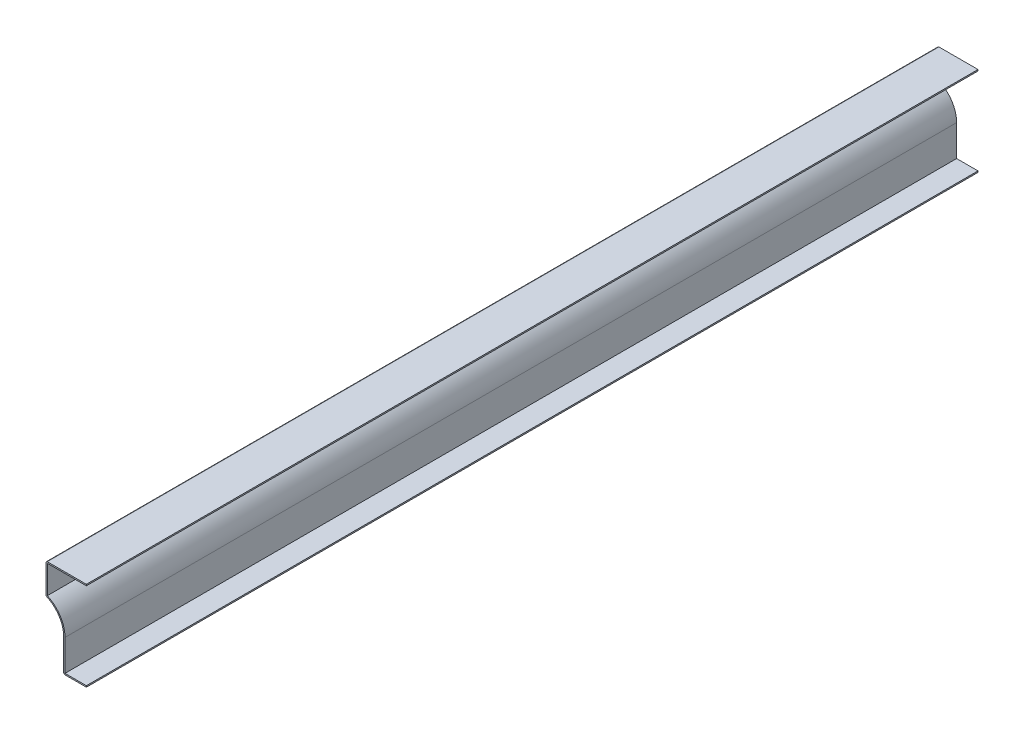
ISO-10303-21;
HEADER;
FILE_DESCRIPTION(('STEP AP214'),'2;1');
FILE_NAME('part.step','',(''),(''),'','','');
FILE_SCHEMA(('AUTOMOTIVE_DESIGN { 1 0 10303 214 1 1 1 1 }'));
ENDSEC;
DATA;
#1=APPLICATION_CONTEXT('core data for automotive mechanical design processes');
#2=APPLICATION_PROTOCOL_DEFINITION('international standard','automotive_design',2000,#1);
#3=PRODUCT_CONTEXT('',#1,'mechanical');
#4=PRODUCT('Part','Part','',(#3));
#5=PRODUCT_RELATED_PRODUCT_CATEGORY('part','',(#4));
#6=PRODUCT_DEFINITION_FORMATION('','',#4);
#7=PRODUCT_DEFINITION_CONTEXT('part definition',#1,'design');
#8=PRODUCT_DEFINITION('design','',#6,#7);
#9=PRODUCT_DEFINITION_SHAPE('','',#8);
#10=(LENGTH_UNIT() NAMED_UNIT(*) SI_UNIT(.MILLI.,.METRE.));
#11=(NAMED_UNIT(*) PLANE_ANGLE_UNIT() SI_UNIT($,.RADIAN.));
#12=(NAMED_UNIT(*) SI_UNIT($,.STERADIAN.) SOLID_ANGLE_UNIT());
#13=UNCERTAINTY_MEASURE_WITH_UNIT(LENGTH_MEASURE(1.E-05),#10,'distance_accuracy_value','');
#14=(GEOMETRIC_REPRESENTATION_CONTEXT(3) GLOBAL_UNCERTAINTY_ASSIGNED_CONTEXT((#13)) GLOBAL_UNIT_ASSIGNED_CONTEXT((#10,
#11,#12)) REPRESENTATION_CONTEXT('',''));
#15=CARTESIAN_POINT('',(0.,0.,0.));
#16=DIRECTION('',(0.,0.,1.));
#17=DIRECTION('',(1.,0.,0.));
#18=AXIS2_PLACEMENT_3D('',#15,#16,#17);
#19=CARTESIAN_POINT('',(-38.1,82.8675,-841.375));
#20=DIRECTION('',(0.,-1.,0.));
#21=DIRECTION('',(1.,0.,0.));
#22=AXIS2_PLACEMENT_3D('',#19,#20,#21);
#23=PLANE('',#22);
#24=DIRECTION('',(1.,0.,0.));
#25=VECTOR('',#24,1.);
#26=CARTESIAN_POINT('',(-38.1,82.8675,0.));
#27=LINE('',#26,#25);
#28=CARTESIAN_POINT('',(-36.83,82.8675,0.));
#29=VERTEX_POINT('',#28);
#30=CARTESIAN_POINT('',(0.,82.8675,0.));
#31=VERTEX_POINT('',#30);
#32=EDGE_CURVE('E196',#29,#31,#27,.T.);
#33=ORIENTED_EDGE('',*,*,#32,.F.);
#34=DIRECTION('',(0.,0.,1.));
#35=VECTOR('',#34,1.);
#36=CARTESIAN_POINT('',(-36.83,82.8675,-841.375));
#37=LINE('',#36,#35);
#38=CARTESIAN_POINT('',(-36.83,82.8675,-841.375));
#39=VERTEX_POINT('',#38);
#40=EDGE_CURVE('E167',#39,#29,#37,.T.);
#41=ORIENTED_EDGE('',*,*,#40,.F.);
#42=DIRECTION('',(1.,0.,0.));
#43=VECTOR('',#42,1.);
#44=CARTESIAN_POINT('',(-38.1,82.8675,-841.375));
#45=LINE('',#44,#43);
#46=CARTESIAN_POINT('',(0.,82.8675,-841.375));
#47=VERTEX_POINT('',#46);
#48=EDGE_CURVE('E149',#39,#47,#45,.T.);
#49=ORIENTED_EDGE('',*,*,#48,.T.);
#50=DIRECTION('',(0.,0.,1.));
#51=VECTOR('',#50,1.);
#52=CARTESIAN_POINT('',(0.,82.8675,-841.375));
#53=LINE('',#52,#51);
#54=EDGE_CURVE('E157',#47,#31,#53,.T.);
#55=ORIENTED_EDGE('',*,*,#54,.T.);
#56=EDGE_LOOP('',(#33,#41,#49,#55));
#57=FACE_BOUND('',#56,.T.);
#58=ADVANCED_FACE('F35',(#57),#23,.T.);
#59=CARTESIAN_POINT('',(-36.83,55.5625,-841.375));
#60=DIRECTION('',(1.,0.,0.));
#61=DIRECTION('',(0.,1.,0.));
#62=AXIS2_PLACEMENT_3D('',#59,#60,#61);
#63=PLANE('',#62);
#64=DIRECTION('',(0.,1.,0.));
#65=VECTOR('',#64,1.);
#66=CARTESIAN_POINT('',(-36.83,55.5625,0.));
#67=LINE('',#66,#65);
#68=CARTESIAN_POINT('',(-36.83,56.3974377479028,0.));
#69=VERTEX_POINT('',#68);
#70=EDGE_CURVE('E168',#69,#29,#67,.T.);
#71=ORIENTED_EDGE('',*,*,#70,.F.);
#72=DIRECTION('',(0.,0.,1.));
#73=VECTOR('',#72,1.);
#74=CARTESIAN_POINT('',(-36.83,56.3974377479028,-841.375));
#75=LINE('',#74,#73);
#76=CARTESIAN_POINT('',(-36.83,56.3974377479028,-841.375));
#77=VERTEX_POINT('',#76);
#78=EDGE_CURVE('E223',#77,#69,#75,.T.);
#79=ORIENTED_EDGE('',*,*,#78,.F.);
#80=DIRECTION('',(0.,1.,0.));
#81=VECTOR('',#80,1.);
#82=CARTESIAN_POINT('',(-36.83,55.5625,-841.375));
#83=LINE('',#82,#81);
#84=EDGE_CURVE('E165',#77,#39,#83,.T.);
#85=ORIENTED_EDGE('',*,*,#84,.T.);
#86=ORIENTED_EDGE('',*,*,#40,.T.);
#87=EDGE_LOOP('',(#71,#79,#85,#86));
#88=FACE_BOUND('',#87,.T.);
#89=ADVANCED_FACE('F280',(#88),#63,.T.);
#90=CARTESIAN_POINT('',(-48.41875,30.6256085600571,-841.375));
#91=DIRECTION('',(0.,0.,1.));
#92=DIRECTION('',(1.,0.,0.));
#93=AXIS2_PLACEMENT_3D('',#90,#91,#92);
#94=CYLINDRICAL_SURFACE('',#93,28.2575);
#95=CARTESIAN_POINT('',(-48.41875,30.6256085600571,0.));
#96=DIRECTION('',(0.,0.,1.));
#97=DIRECTION('',(1.,0.,0.));
#98=AXIS2_PLACEMENT_3D('',#95,#96,#97);
#99=CIRCLE('',#98,28.2575);
#100=CARTESIAN_POINT('',(-20.16125,30.6256085600571,0.));
#101=VERTEX_POINT('',#100);
#102=EDGE_CURVE('E171',#101,#69,#99,.T.);
#103=ORIENTED_EDGE('',*,*,#102,.F.);
#104=DIRECTION('',(0.,0.,1.));
#105=VECTOR('',#104,1.);
#106=CARTESIAN_POINT('',(-20.16125,30.6256085600571,-841.375));
#107=LINE('',#106,#105);
#108=CARTESIAN_POINT('',(-20.16125,30.6256085600571,-841.375));
#109=VERTEX_POINT('',#108);
#110=EDGE_CURVE('E225',#109,#101,#107,.T.);
#111=ORIENTED_EDGE('',*,*,#110,.F.);
#112=CARTESIAN_POINT('',(-48.41875,30.6256085600571,-841.375));
#113=DIRECTION('',(0.,0.,1.));
#114=DIRECTION('',(1.,0.,0.));
#115=AXIS2_PLACEMENT_3D('',#112,#113,#114);
#116=CIRCLE('',#115,28.2575);
#117=EDGE_CURVE('E192',#109,#77,#116,.T.);
#118=ORIENTED_EDGE('',*,*,#117,.T.);
#119=ORIENTED_EDGE('',*,*,#78,.T.);
#120=EDGE_LOOP('',(#103,#111,#118,#119));
#121=FACE_BOUND('',#120,.T.);
#122=ADVANCED_FACE('F320',(#121),#94,.T.);
#123=CARTESIAN_POINT('',(-20.16125,0.,-841.375));
#124=DIRECTION('',(1.,0.,0.));
#125=DIRECTION('',(0.,1.,0.));
#126=AXIS2_PLACEMENT_3D('',#123,#124,#125);
#127=PLANE('',#126);
#128=DIRECTION('',(0.,1.,0.));
#129=VECTOR('',#128,1.);
#130=CARTESIAN_POINT('',(-20.16125,0.,0.));
#131=LINE('',#130,#129);
#132=CARTESIAN_POINT('',(-20.16125,1.27,0.));
#133=VERTEX_POINT('',#132);
#134=EDGE_CURVE('E216',#133,#101,#131,.T.);
#135=ORIENTED_EDGE('',*,*,#134,.F.);
#136=DIRECTION('',(0.,0.,1.));
#137=VECTOR('',#136,1.);
#138=CARTESIAN_POINT('',(-20.16125,1.27,-841.375));
#139=LINE('',#138,#137);
#140=CARTESIAN_POINT('',(-20.16125,1.27,-841.375));
#141=VERTEX_POINT('',#140);
#142=EDGE_CURVE('E227',#141,#133,#139,.T.);
#143=ORIENTED_EDGE('',*,*,#142,.F.);
#144=DIRECTION('',(0.,1.,0.));
#145=VECTOR('',#144,1.);
#146=CARTESIAN_POINT('',(-20.16125,0.,-841.375));
#147=LINE('',#146,#145);
#148=EDGE_CURVE('E189',#141,#109,#147,.T.);
#149=ORIENTED_EDGE('',*,*,#148,.T.);
#150=ORIENTED_EDGE('',*,*,#110,.T.);
#151=EDGE_LOOP('',(#135,#143,#149,#150));
#152=FACE_BOUND('',#151,.T.);
#153=ADVANCED_FACE('F287',(#152),#127,.T.);
#154=CARTESIAN_POINT('',(0.,1.27,-841.375));
#155=DIRECTION('',(0.,1.,0.));
#156=DIRECTION('',(-1.,0.,0.));
#157=AXIS2_PLACEMENT_3D('',#154,#155,#156);
#158=PLANE('',#157);
#159=DIRECTION('',(-1.,0.,0.));
#160=VECTOR('',#159,1.);
#161=CARTESIAN_POINT('',(0.,1.27,0.));
#162=LINE('',#161,#160);
#163=CARTESIAN_POINT('',(0.,1.27,0.));
#164=VERTEX_POINT('',#163);
#165=EDGE_CURVE('E213',#164,#133,#162,.T.);
#166=ORIENTED_EDGE('',*,*,#165,.F.);
#167=DIRECTION('',(0.,0.,1.));
#168=VECTOR('',#167,1.);
#169=CARTESIAN_POINT('',(0.,1.27,-841.375));
#170=LINE('',#169,#168);
#171=CARTESIAN_POINT('',(0.,1.27,-841.375));
#172=VERTEX_POINT('',#171);
#173=EDGE_CURVE('E229',#172,#164,#170,.T.);
#174=ORIENTED_EDGE('',*,*,#173,.F.);
#175=DIRECTION('',(-1.,0.,0.));
#176=VECTOR('',#175,1.);
#177=CARTESIAN_POINT('',(0.,1.27,-841.375));
#178=LINE('',#177,#176);
#179=EDGE_CURVE('E186',#172,#141,#178,.T.);
#180=ORIENTED_EDGE('',*,*,#179,.T.);
#181=ORIENTED_EDGE('',*,*,#142,.T.);
#182=EDGE_LOOP('',(#166,#174,#180,#181));
#183=FACE_BOUND('',#182,.T.);
#184=ADVANCED_FACE('F290',(#183),#158,.T.);
#185=CARTESIAN_POINT('',(0.,1.27,-841.375));
#186=DIRECTION('',(-1.,0.,0.));
#187=DIRECTION('',(0.,-1.,0.));
#188=AXIS2_PLACEMENT_3D('',#185,#186,#187);
#189=PLANE('',#188);
#190=DIRECTION('',(0.,-1.,0.));
#191=VECTOR('',#190,1.);
#192=CARTESIAN_POINT('',(0.,1.27,0.));
#193=LINE('',#192,#191);
#194=CARTESIAN_POINT('',(0.,0.,0.));
#195=VERTEX_POINT('',#194);
#196=EDGE_CURVE('E211',#164,#195,#193,.T.);
#197=ORIENTED_EDGE('',*,*,#196,.T.);
#198=DIRECTION('',(0.,0.,1.));
#199=VECTOR('',#198,1.);
#200=CARTESIAN_POINT('',(0.,0.,-841.375));
#201=LINE('',#200,#199);
#202=CARTESIAN_POINT('',(0.,0.,-841.375));
#203=VERTEX_POINT('',#202);
#204=EDGE_CURVE('E231',#203,#195,#201,.T.);
#205=ORIENTED_EDGE('',*,*,#204,.F.);
#206=DIRECTION('',(0.,-1.,0.));
#207=VECTOR('',#206,1.);
#208=CARTESIAN_POINT('',(0.,1.27,-841.375));
#209=LINE('',#208,#207);
#210=EDGE_CURVE('E184',#172,#203,#209,.T.);
#211=ORIENTED_EDGE('',*,*,#210,.F.);
#212=ORIENTED_EDGE('',*,*,#173,.T.);
#213=EDGE_LOOP('',(#197,#205,#211,#212));
#214=FACE_BOUND('',#213,.T.);
#215=ADVANCED_FACE('F296',(#214),#189,.F.);
#216=CARTESIAN_POINT('',(0.,0.,-841.375));
#217=DIRECTION('',(0.,1.,0.));
#218=DIRECTION('',(-1.,0.,0.));
#219=AXIS2_PLACEMENT_3D('',#216,#217,#218);
#220=PLANE('',#219);
#221=DIRECTION('',(-1.,0.,0.));
#222=VECTOR('',#221,1.);
#223=CARTESIAN_POINT('',(0.,0.,0.));
#224=LINE('',#223,#222);
#225=CARTESIAN_POINT('',(-20.16125,0.,0.));
#226=VERTEX_POINT('',#225);
#227=EDGE_CURVE('E208',#195,#226,#224,.T.);
#228=ORIENTED_EDGE('',*,*,#227,.T.);
#229=DIRECTION('',(0.,0.,1.));
#230=VECTOR('',#229,1.);
#231=CARTESIAN_POINT('',(-20.16125,0.,-841.375));
#232=LINE('',#231,#230);
#233=CARTESIAN_POINT('',(-20.16125,0.,-841.375));
#234=VERTEX_POINT('',#233);
#235=EDGE_CURVE('E246',#226,#234,#232,.F.);
#236=ORIENTED_EDGE('',*,*,#235,.T.);
#237=DIRECTION('',(-1.,0.,0.));
#238=VECTOR('',#237,1.);
#239=CARTESIAN_POINT('',(0.,0.,-841.375));
#240=LINE('',#239,#238);
#241=EDGE_CURVE('E182',#203,#234,#240,.T.);
#242=ORIENTED_EDGE('',*,*,#241,.F.);
#243=ORIENTED_EDGE('',*,*,#204,.T.);
#244=EDGE_LOOP('',(#228,#236,#242,#243));
#245=FACE_BOUND('',#244,.T.);
#246=ADVANCED_FACE('F300',(#245),#220,.F.);
#247=CARTESIAN_POINT('',(-21.43125,0.,-841.375));
#248=DIRECTION('',(1.,0.,0.));
#249=DIRECTION('',(0.,1.,0.));
#250=AXIS2_PLACEMENT_3D('',#247,#248,#249);
#251=PLANE('',#250);
#252=DIRECTION('',(0.,1.,0.));
#253=VECTOR('',#252,1.);
#254=CARTESIAN_POINT('',(-21.43125,0.,-841.375));
#255=LINE('',#254,#253);
#256=CARTESIAN_POINT('',(-21.43125,1.27,-841.375));
#257=VERTEX_POINT('',#256);
#258=CARTESIAN_POINT('',(-21.43125,30.6256085600571,-841.375));
#259=VERTEX_POINT('',#258);
#260=EDGE_CURVE('E180',#257,#259,#255,.T.);
#261=ORIENTED_EDGE('',*,*,#260,.F.);
#262=DIRECTION('',(0.,0.,1.));
#263=VECTOR('',#262,1.);
#264=CARTESIAN_POINT('',(-21.43125,1.27,-841.375));
#265=LINE('',#264,#263);
#266=CARTESIAN_POINT('',(-21.43125,1.27,0.));
#267=VERTEX_POINT('',#266);
#268=EDGE_CURVE('E222',#257,#267,#265,.T.);
#269=ORIENTED_EDGE('',*,*,#268,.T.);
#270=DIRECTION('',(0.,1.,0.));
#271=VECTOR('',#270,1.);
#272=CARTESIAN_POINT('',(-21.43125,0.,0.));
#273=LINE('',#272,#271);
#274=CARTESIAN_POINT('',(-21.43125,30.6256085600571,0.));
#275=VERTEX_POINT('',#274);
#276=EDGE_CURVE('E206',#267,#275,#273,.T.);
#277=ORIENTED_EDGE('',*,*,#276,.T.);
#278=DIRECTION('',(0.,0.,1.));
#279=VECTOR('',#278,1.);
#280=CARTESIAN_POINT('',(-21.43125,30.6256085600571,-841.375));
#281=LINE('',#280,#279);
#282=EDGE_CURVE('E234',#259,#275,#281,.T.);
#283=ORIENTED_EDGE('',*,*,#282,.F.);
#284=EDGE_LOOP('',(#261,#269,#277,#283));
#285=FACE_BOUND('',#284,.T.);
#286=ADVANCED_FACE('F306',(#285),#251,.F.);
#287=CARTESIAN_POINT('',(-48.41875,30.6256085600571,-841.375));
#288=DIRECTION('',(0.,0.,1.));
#289=DIRECTION('',(1.,0.,0.));
#290=AXIS2_PLACEMENT_3D('',#287,#288,#289);
#291=CYLINDRICAL_SURFACE('',#290,26.9875);
#292=CARTESIAN_POINT('',(-48.41875,30.6256085600571,0.));
#293=DIRECTION('',(0.,0.,1.));
#294=DIRECTION('',(1.,0.,0.));
#295=AXIS2_PLACEMENT_3D('',#292,#293,#294);
#296=CIRCLE('',#295,26.9875);
#297=CARTESIAN_POINT('',(-37.3508426966292,55.2391532900221,0.));
#298=VERTEX_POINT('',#297);
#299=EDGE_CURVE('E203',#275,#298,#296,.T.);
#300=ORIENTED_EDGE('',*,*,#299,.T.);
#301=DIRECTION('',(0.,0.,1.));
#302=VECTOR('',#301,1.);
#303=CARTESIAN_POINT('',(-37.3508426966292,55.2391532900221,-841.375));
#304=LINE('',#303,#302);
#305=CARTESIAN_POINT('',(-37.3508426966292,55.2391532900221,-841.375));
#306=VERTEX_POINT('',#305);
#307=EDGE_CURVE('E43',#298,#306,#304,.F.);
#308=ORIENTED_EDGE('',*,*,#307,.T.);
#309=CARTESIAN_POINT('',(-48.41875,30.6256085600571,-841.375));
#310=DIRECTION('',(0.,0.,1.));
#311=DIRECTION('',(1.,0.,0.));
#312=AXIS2_PLACEMENT_3D('',#309,#310,#311);
#313=CIRCLE('',#312,26.9875);
#314=EDGE_CURVE('E177',#259,#306,#313,.T.);
#315=ORIENTED_EDGE('',*,*,#314,.F.);
#316=ORIENTED_EDGE('',*,*,#282,.T.);
#317=EDGE_LOOP('',(#300,#308,#315,#316));
#318=FACE_BOUND('',#317,.T.);
#319=ADVANCED_FACE('F259',(#318),#291,.F.);
#320=CARTESIAN_POINT('',(-38.1,55.5625,-841.375));
#321=DIRECTION('',(1.,0.,0.));
#322=DIRECTION('',(0.,1.,0.));
#323=AXIS2_PLACEMENT_3D('',#320,#321,#322);
#324=PLANE('',#323);
#325=DIRECTION('',(0.,1.,0.));
#326=VECTOR('',#325,1.);
#327=CARTESIAN_POINT('',(-38.1,55.5625,-841.375));
#328=LINE('',#327,#326);
#329=CARTESIAN_POINT('',(-38.1,56.3974377479028,-841.375));
#330=VERTEX_POINT('',#329);
#331=CARTESIAN_POINT('',(-38.1,82.8675,-841.375));
#332=VERTEX_POINT('',#331);
#333=EDGE_CURVE('E175',#330,#332,#328,.T.);
#334=ORIENTED_EDGE('',*,*,#333,.F.);
#335=DIRECTION('',(0.,0.,1.));
#336=VECTOR('',#335,1.);
#337=CARTESIAN_POINT('',(-38.1,56.3974377479028,-841.375));
#338=LINE('',#337,#336);
#339=CARTESIAN_POINT('',(-38.1,56.3974377479028,0.));
#340=VERTEX_POINT('',#339);
#341=EDGE_CURVE('E254',#330,#340,#338,.T.);
#342=ORIENTED_EDGE('',*,*,#341,.T.);
#343=DIRECTION('',(0.,1.,0.));
#344=VECTOR('',#343,1.);
#345=CARTESIAN_POINT('',(-38.1,55.5625,0.));
#346=LINE('',#345,#344);
#347=CARTESIAN_POINT('',(-38.1,82.8675,0.));
#348=VERTEX_POINT('',#347);
#349=EDGE_CURVE('E201',#340,#348,#346,.T.);
#350=ORIENTED_EDGE('',*,*,#349,.T.);
#351=DIRECTION('',(0.,0.,1.));
#352=VECTOR('',#351,1.);
#353=CARTESIAN_POINT('',(-38.1,82.8675,-841.375));
#354=LINE('',#353,#352);
#355=EDGE_CURVE('E58',#348,#332,#354,.F.);
#356=ORIENTED_EDGE('',*,*,#355,.T.);
#357=EDGE_LOOP('',(#334,#342,#350,#356));
#358=FACE_BOUND('',#357,.T.);
#359=ADVANCED_FACE('F268',(#358),#324,.F.);
#360=CARTESIAN_POINT('',(-38.1,84.1375,-841.375));
#361=DIRECTION('',(0.,-1.,0.));
#362=DIRECTION('',(1.,0.,0.));
#363=AXIS2_PLACEMENT_3D('',#360,#361,#362);
#364=PLANE('',#363);
#365=DIRECTION('',(1.,0.,0.));
#366=VECTOR('',#365,1.);
#367=CARTESIAN_POINT('',(-38.1,84.1375,-841.375));
#368=LINE('',#367,#366);
#369=CARTESIAN_POINT('',(-36.83,84.1375,-841.375));
#370=VERTEX_POINT('',#369);
#371=CARTESIAN_POINT('',(0.,84.1375,-841.375));
#372=VERTEX_POINT('',#371);
#373=EDGE_CURVE('E151',#370,#372,#368,.T.);
#374=ORIENTED_EDGE('',*,*,#373,.F.);
#375=DIRECTION('',(0.,0.,1.));
#376=VECTOR('',#375,1.);
#377=CARTESIAN_POINT('',(-36.83,84.1375,-841.375));
#378=LINE('',#377,#376);
#379=CARTESIAN_POINT('',(-36.83,84.1375,0.));
#380=VERTEX_POINT('',#379);
#381=EDGE_CURVE('E11',#370,#380,#378,.T.);
#382=ORIENTED_EDGE('',*,*,#381,.T.);
#383=DIRECTION('',(1.,0.,0.));
#384=VECTOR('',#383,1.);
#385=CARTESIAN_POINT('',(-38.1,84.1375,0.));
#386=LINE('',#385,#384);
#387=CARTESIAN_POINT('',(0.,84.1375,0.));
#388=VERTEX_POINT('',#387);
#389=EDGE_CURVE('E199',#380,#388,#386,.T.);
#390=ORIENTED_EDGE('',*,*,#389,.T.);
#391=DIRECTION('',(0.,0.,1.));
#392=VECTOR('',#391,1.);
#393=CARTESIAN_POINT('',(0.,84.1375,-841.375));
#394=LINE('',#393,#392);
#395=EDGE_CURVE('E164',#372,#388,#394,.T.);
#396=ORIENTED_EDGE('',*,*,#395,.F.);
#397=EDGE_LOOP('',(#374,#382,#390,#396));
#398=FACE_BOUND('',#397,.T.);
#399=ADVANCED_FACE('F276',(#398),#364,.F.);
#400=CARTESIAN_POINT('',(0.,84.1375,-841.375));
#401=DIRECTION('',(-1.,0.,0.));
#402=DIRECTION('',(0.,0.,1.));
#403=AXIS2_PLACEMENT_3D('',#400,#401,#402);
#404=PLANE('',#403);
#405=DIRECTION('',(0.,-1.,0.));
#406=VECTOR('',#405,1.);
#407=CARTESIAN_POINT('',(0.,84.1375,0.));
#408=LINE('',#407,#406);
#409=EDGE_CURVE('E160',#388,#31,#408,.T.);
#410=ORIENTED_EDGE('',*,*,#409,.T.);
#411=ORIENTED_EDGE('',*,*,#54,.F.);
#412=DIRECTION('',(0.,-1.,0.));
#413=VECTOR('',#412,1.);
#414=CARTESIAN_POINT('',(0.,84.1375,-841.375));
#415=LINE('',#414,#413);
#416=EDGE_CURVE('E143',#372,#47,#415,.T.);
#417=ORIENTED_EDGE('',*,*,#416,.F.);
#418=ORIENTED_EDGE('',*,*,#395,.T.);
#419=EDGE_LOOP('',(#410,#411,#417,#418));
#420=FACE_BOUND('',#419,.T.);
#421=ADVANCED_FACE('F158',(#420),#404,.F.);
#422=CARTESIAN_POINT('',(-48.41875,30.6256085600571,-841.375));
#423=DIRECTION('',(0.,0.,1.));
#424=DIRECTION('',(1.,0.,0.));
#425=AXIS2_PLACEMENT_3D('',#422,#423,#424);
#426=PLANE('',#425);
#427=ORIENTED_EDGE('',*,*,#241,.T.);
#428=CARTESIAN_POINT('',(-20.16125,1.27,-841.375));
#429=DIRECTION('',(0.,0.,1.));
#430=DIRECTION('',(1.,0.,0.));
#431=AXIS2_PLACEMENT_3D('',#428,#429,#430);
#432=CIRCLE('',#431,1.27);
#433=EDGE_CURVE('E251',#234,#257,#432,.F.);
#434=ORIENTED_EDGE('',*,*,#433,.T.);
#435=ORIENTED_EDGE('',*,*,#260,.T.);
#436=ORIENTED_EDGE('',*,*,#314,.T.);
#437=CARTESIAN_POINT('',(-36.83,56.3974377479028,-841.375));
#438=DIRECTION('',(0.,0.,1.));
#439=DIRECTION('',(1.,0.,0.));
#440=AXIS2_PLACEMENT_3D('',#437,#438,#439);
#441=CIRCLE('',#440,1.27);
#442=EDGE_CURVE('E249',#306,#330,#441,.F.);
#443=ORIENTED_EDGE('',*,*,#442,.T.);
#444=ORIENTED_EDGE('',*,*,#333,.T.);
#445=CARTESIAN_POINT('',(-36.83,82.8675,-841.375));
#446=DIRECTION('',(0.,0.,1.));
#447=DIRECTION('',(1.,0.,0.));
#448=AXIS2_PLACEMENT_3D('',#445,#446,#447);
#449=CIRCLE('',#448,1.27);
#450=EDGE_CURVE('E50',#332,#370,#449,.F.);
#451=ORIENTED_EDGE('',*,*,#450,.T.);
#452=ORIENTED_EDGE('',*,*,#373,.T.);
#453=ORIENTED_EDGE('',*,*,#416,.T.);
#454=ORIENTED_EDGE('',*,*,#48,.F.);
#455=ORIENTED_EDGE('',*,*,#84,.F.);
#456=ORIENTED_EDGE('',*,*,#117,.F.);
#457=ORIENTED_EDGE('',*,*,#148,.F.);
#458=ORIENTED_EDGE('',*,*,#179,.F.);
#459=ORIENTED_EDGE('',*,*,#210,.T.);
#460=EDGE_LOOP('',(#427,#434,#435,#436,#443,#444,#451,#452,#453,#454,#455,#456,#457,#458,#459));
#461=FACE_BOUND('',#460,.T.);
#462=ADVANCED_FACE('F146',(#461),#426,.F.);
#463=CARTESIAN_POINT('',(-48.41875,30.6256085600571,0.));
#464=DIRECTION('',(0.,0.,1.));
#465=DIRECTION('',(1.,0.,0.));
#466=AXIS2_PLACEMENT_3D('',#463,#464,#465);
#467=PLANE('',#466);
#468=ORIENTED_EDGE('',*,*,#276,.F.);
#469=CARTESIAN_POINT('',(-20.16125,1.27,0.));
#470=DIRECTION('',(0.,0.,1.));
#471=DIRECTION('',(1.,0.,0.));
#472=AXIS2_PLACEMENT_3D('',#469,#470,#471);
#473=CIRCLE('',#472,1.27);
#474=EDGE_CURVE('E244',#267,#226,#473,.T.);
#475=ORIENTED_EDGE('',*,*,#474,.T.);
#476=ORIENTED_EDGE('',*,*,#227,.F.);
#477=ORIENTED_EDGE('',*,*,#196,.F.);
#478=ORIENTED_EDGE('',*,*,#165,.T.);
#479=ORIENTED_EDGE('',*,*,#134,.T.);
#480=ORIENTED_EDGE('',*,*,#102,.T.);
#481=ORIENTED_EDGE('',*,*,#70,.T.);
#482=ORIENTED_EDGE('',*,*,#32,.T.);
#483=ORIENTED_EDGE('',*,*,#409,.F.);
#484=ORIENTED_EDGE('',*,*,#389,.F.);
#485=CARTESIAN_POINT('',(-36.83,82.8675,0.));
#486=DIRECTION('',(0.,0.,1.));
#487=DIRECTION('',(1.,0.,0.));
#488=AXIS2_PLACEMENT_3D('',#485,#486,#487);
#489=CIRCLE('',#488,1.27);
#490=EDGE_CURVE('E240',#380,#348,#489,.T.);
#491=ORIENTED_EDGE('',*,*,#490,.T.);
#492=ORIENTED_EDGE('',*,*,#349,.F.);
#493=CARTESIAN_POINT('',(-36.83,56.3974377479028,0.));
#494=DIRECTION('',(0.,0.,1.));
#495=DIRECTION('',(1.,0.,0.));
#496=AXIS2_PLACEMENT_3D('',#493,#494,#495);
#497=CIRCLE('',#496,1.27);
#498=EDGE_CURVE('E242',#340,#298,#497,.T.);
#499=ORIENTED_EDGE('',*,*,#498,.T.);
#500=ORIENTED_EDGE('',*,*,#299,.F.);
#501=EDGE_LOOP('',(#468,#475,#476,#477,#478,#479,#480,#481,#482,#483,#484,#491,#492,#499,#500));
#502=FACE_BOUND('',#501,.T.);
#503=ADVANCED_FACE('F271',(#502),#467,.T.);
#504=CARTESIAN_POINT('',(-20.16125,1.27,-841.375));
#505=DIRECTION('',(0.,0.,1.));
#506=DIRECTION('',(1.,0.,0.));
#507=AXIS2_PLACEMENT_3D('',#504,#505,#506);
#508=CYLINDRICAL_SURFACE('',#507,1.27);
#509=ORIENTED_EDGE('',*,*,#433,.F.);
#510=ORIENTED_EDGE('',*,*,#235,.F.);
#511=ORIENTED_EDGE('',*,*,#474,.F.);
#512=ORIENTED_EDGE('',*,*,#268,.F.);
#513=EDGE_LOOP('',(#509,#510,#511,#512));
#514=FACE_BOUND('',#513,.T.);
#515=ADVANCED_FACE('F303',(#514),#508,.T.);
#516=CARTESIAN_POINT('',(-36.83,56.3974377479028,-841.375));
#517=DIRECTION('',(0.,0.,1.));
#518=DIRECTION('',(1.,0.,0.));
#519=AXIS2_PLACEMENT_3D('',#516,#517,#518);
#520=CYLINDRICAL_SURFACE('',#519,1.27);
#521=ORIENTED_EDGE('',*,*,#442,.F.);
#522=ORIENTED_EDGE('',*,*,#307,.F.);
#523=ORIENTED_EDGE('',*,*,#498,.F.);
#524=ORIENTED_EDGE('',*,*,#341,.F.);
#525=EDGE_LOOP('',(#521,#522,#523,#524));
#526=FACE_BOUND('',#525,.T.);
#527=ADVANCED_FACE('F266',(#526),#520,.T.);
#528=CARTESIAN_POINT('',(-36.83,82.8675,-841.375));
#529=DIRECTION('',(0.,0.,1.));
#530=DIRECTION('',(1.,0.,0.));
#531=AXIS2_PLACEMENT_3D('',#528,#529,#530);
#532=CYLINDRICAL_SURFACE('',#531,1.27);
#533=ORIENTED_EDGE('',*,*,#450,.F.);
#534=ORIENTED_EDGE('',*,*,#355,.F.);
#535=ORIENTED_EDGE('',*,*,#490,.F.);
#536=ORIENTED_EDGE('',*,*,#381,.F.);
#537=EDGE_LOOP('',(#533,#534,#535,#536));
#538=FACE_BOUND('',#537,.T.);
#539=ADVANCED_FACE('F37',(#538),#532,.T.);
#540=CLOSED_SHELL('',(#58,#89,#122,#153,#184,#215,#246,#286,#319,#359,#399,#421,#462,#503,#515,
#527,#539));
#541=MANIFOLD_SOLID_BREP('B2',#540);
#542=ADVANCED_BREP_SHAPE_REPRESENTATION('',(#18,#541),#14);
#543=SHAPE_DEFINITION_REPRESENTATION(#9,#542);
ENDSEC;
END-ISO-10303-21;
